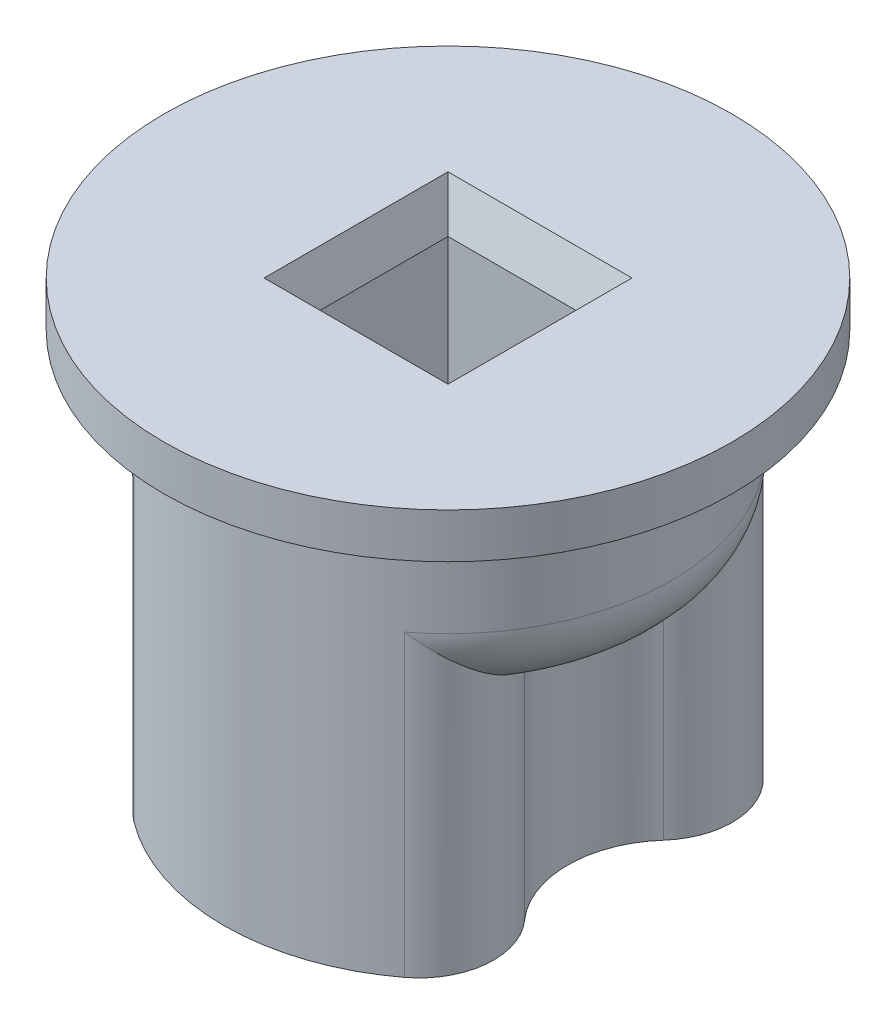
ISO-10303-21;
HEADER;
FILE_DESCRIPTION(('STEP AP214'),'2;1');
FILE_NAME('part.step','',(''),(''),'','','');
FILE_SCHEMA(('AUTOMOTIVE_DESIGN { 1 0 10303 214 1 1 1 1 }'));
ENDSEC;
DATA;
#1=APPLICATION_CONTEXT('core data for automotive mechanical design processes');
#2=APPLICATION_PROTOCOL_DEFINITION('international standard','automotive_design',2000,#1);
#3=PRODUCT_CONTEXT('',#1,'mechanical');
#4=PRODUCT('Part','Part','',(#3));
#5=PRODUCT_RELATED_PRODUCT_CATEGORY('part','',(#4));
#6=PRODUCT_DEFINITION_FORMATION('','',#4);
#7=PRODUCT_DEFINITION_CONTEXT('part definition',#1,'design');
#8=PRODUCT_DEFINITION('design','',#6,#7);
#9=PRODUCT_DEFINITION_SHAPE('','',#8);
#10=(LENGTH_UNIT() NAMED_UNIT(*) SI_UNIT(.MILLI.,.METRE.));
#11=(NAMED_UNIT(*) PLANE_ANGLE_UNIT() SI_UNIT($,.RADIAN.));
#12=(NAMED_UNIT(*) SI_UNIT($,.STERADIAN.) SOLID_ANGLE_UNIT());
#13=UNCERTAINTY_MEASURE_WITH_UNIT(LENGTH_MEASURE(1.E-05),#10,'distance_accuracy_value','');
#14=(GEOMETRIC_REPRESENTATION_CONTEXT(3) GLOBAL_UNCERTAINTY_ASSIGNED_CONTEXT((#13)) GLOBAL_UNIT_ASSIGNED_CONTEXT((#10,
#11,#12)) REPRESENTATION_CONTEXT('',''));
#15=CARTESIAN_POINT('',(0.,0.,0.));
#16=DIRECTION('',(0.,0.,1.));
#17=DIRECTION('',(1.,0.,0.));
#18=AXIS2_PLACEMENT_3D('',#15,#16,#17);
#19=CARTESIAN_POINT('',(0.,80.,0.));
#20=DIRECTION('',(0.,-1.,0.));
#21=DIRECTION('',(0.,0.,-1.));
#22=AXIS2_PLACEMENT_3D('',#19,#20,#21);
#23=CYLINDRICAL_SURFACE('',#22,15.);
#24=DIRECTION('',(0.,-1.,0.));
#25=VECTOR('',#24,1.);
#26=CARTESIAN_POINT('',(9.05,80.,11.9623367282484));
#27=LINE('',#26,#25);
#28=CARTESIAN_POINT('',(9.05,50.,11.9623367282484));
#29=VERTEX_POINT('',#28);
#30=CARTESIAN_POINT('',(9.05,70.,11.9623367282484));
#31=VERTEX_POINT('',#30);
#32=EDGE_CURVE('E238',#29,#31,#27,.F.);
#33=ORIENTED_EDGE('',*,*,#32,.T.);
#34=CARTESIAN_POINT('',(0.,70.,0.));
#35=DIRECTION('',(0.,-1.,0.));
#36=DIRECTION('',(0.,0.,-1.));
#37=AXIS2_PLACEMENT_3D('',#34,#35,#36);
#38=CIRCLE('',#37,15.);
#39=CARTESIAN_POINT('',(9.05,70.,-11.9623367282484));
#40=VERTEX_POINT('',#39);
#41=EDGE_CURVE('E260',#31,#40,#38,.F.);
#42=ORIENTED_EDGE('',*,*,#41,.T.);
#43=DIRECTION('',(0.,-1.,0.));
#44=VECTOR('',#43,1.);
#45=CARTESIAN_POINT('',(9.05,80.,-11.9623367282484));
#46=LINE('',#45,#44);
#47=CARTESIAN_POINT('',(9.05,50.,-11.9623367282484));
#48=VERTEX_POINT('',#47);
#49=EDGE_CURVE('E235',#40,#48,#46,.T.);
#50=ORIENTED_EDGE('',*,*,#49,.T.);
#51=CARTESIAN_POINT('',(0.,50.,0.));
#52=DIRECTION('',(0.,1.,0.));
#53=DIRECTION('',(0.,0.,1.));
#54=AXIS2_PLACEMENT_3D('',#51,#52,#53);
#55=CIRCLE('',#54,15.);
#56=CARTESIAN_POINT('',(-9.05,50.,-11.9623367282484));
#57=VERTEX_POINT('',#56);
#58=EDGE_CURVE('E183',#48,#57,#55,.T.);
#59=ORIENTED_EDGE('',*,*,#58,.T.);
#60=DIRECTION('',(0.,-1.,0.));
#61=VECTOR('',#60,1.);
#62=CARTESIAN_POINT('',(-9.05,80.,-11.9623367282484));
#63=LINE('',#62,#61);
#64=CARTESIAN_POINT('',(-9.05,70.,-11.9623367282484));
#65=VERTEX_POINT('',#64);
#66=EDGE_CURVE('E172',#57,#65,#63,.F.);
#67=ORIENTED_EDGE('',*,*,#66,.T.);
#68=CARTESIAN_POINT('',(0.,70.,0.));
#69=DIRECTION('',(0.,-1.,0.));
#70=DIRECTION('',(0.,0.,-1.));
#71=AXIS2_PLACEMENT_3D('',#68,#69,#70);
#72=CIRCLE('',#71,15.);
#73=CARTESIAN_POINT('',(-9.05,70.,11.9623367282484));
#74=VERTEX_POINT('',#73);
#75=EDGE_CURVE('E257',#65,#74,#72,.F.);
#76=ORIENTED_EDGE('',*,*,#75,.T.);
#77=DIRECTION('',(0.,-1.,0.));
#78=VECTOR('',#77,1.);
#79=CARTESIAN_POINT('',(-9.05,80.,11.9623367282484));
#80=LINE('',#79,#78);
#81=CARTESIAN_POINT('',(-9.05,50.,11.9623367282484));
#82=VERTEX_POINT('',#81);
#83=EDGE_CURVE('E232',#74,#82,#80,.T.);
#84=ORIENTED_EDGE('',*,*,#83,.T.);
#85=EDGE_CURVE('E223',#82,#29,#55,.T.);
#86=ORIENTED_EDGE('',*,*,#85,.T.);
#87=EDGE_LOOP('',(#33,#42,#50,#59,#67,#76,#84,#86));
#88=FACE_BOUND('',#87,.T.);
#89=CARTESIAN_POINT('',(0.,77.,0.));
#90=DIRECTION('',(0.,1.,0.));
#91=DIRECTION('',(0.,0.,1.));
#92=AXIS2_PLACEMENT_3D('',#89,#90,#91);
#93=CIRCLE('',#92,15.);
#94=CARTESIAN_POINT('',(0.,77.,15.));
#95=VERTEX_POINT('',#94);
#96=EDGE_CURVE('E197',#95,#95,#93,.T.);
#97=ORIENTED_EDGE('',*,*,#96,.F.);
#98=EDGE_LOOP('',(#97));
#99=FACE_BOUND('',#98,.T.);
#100=ADVANCED_FACE('F42',(#88,#99),#23,.T.);
#101=CARTESIAN_POINT('',(0.,80.,0.));
#102=DIRECTION('',(0.,1.,0.));
#103=DIRECTION('',(0.,0.,1.));
#104=AXIS2_PLACEMENT_3D('',#101,#102,#103);
#105=PLANE('',#104);
#106=DIRECTION('',(1.,0.,0.));
#107=VECTOR('',#106,1.);
#108=CARTESIAN_POINT('',(0.,80.,-6.14999999999999));
#109=LINE('',#108,#107);
#110=CARTESIAN_POINT('',(-6.14999999999999,80.,-6.14999999999999));
#111=VERTEX_POINT('',#110);
#112=CARTESIAN_POINT('',(6.15,80.,-6.14999999999999));
#113=VERTEX_POINT('',#112);
#114=EDGE_CURVE('E206',#111,#113,#109,.T.);
#115=ORIENTED_EDGE('',*,*,#114,.T.);
#116=DIRECTION('',(0.,0.,1.));
#117=VECTOR('',#116,1.);
#118=CARTESIAN_POINT('',(6.15,80.,0.));
#119=LINE('',#118,#117);
#120=CARTESIAN_POINT('',(6.15,80.,6.15));
#121=VERTEX_POINT('',#120);
#122=EDGE_CURVE('E212',#113,#121,#119,.T.);
#123=ORIENTED_EDGE('',*,*,#122,.T.);
#124=DIRECTION('',(-1.,0.,0.));
#125=VECTOR('',#124,1.);
#126=CARTESIAN_POINT('',(0.,80.,6.15));
#127=LINE('',#126,#125);
#128=CARTESIAN_POINT('',(-6.14999999999999,80.,6.15));
#129=VERTEX_POINT('',#128);
#130=EDGE_CURVE('E210',#121,#129,#127,.T.);
#131=ORIENTED_EDGE('',*,*,#130,.T.);
#132=DIRECTION('',(0.,0.,-1.));
#133=VECTOR('',#132,1.);
#134=CARTESIAN_POINT('',(-6.14999999999999,80.,0.));
#135=LINE('',#134,#133);
#136=EDGE_CURVE('E208',#129,#111,#135,.T.);
#137=ORIENTED_EDGE('',*,*,#136,.T.);
#138=EDGE_LOOP('',(#115,#123,#131,#137));
#139=FACE_BOUND('',#138,.T.);
#140=CARTESIAN_POINT('',(0.,80.,0.));
#141=DIRECTION('',(0.,1.,0.));
#142=DIRECTION('',(0.,0.,1.));
#143=AXIS2_PLACEMENT_3D('',#140,#141,#142);
#144=CIRCLE('',#143,19.);
#145=CARTESIAN_POINT('',(0.,80.,19.));
#146=VERTEX_POINT('',#145);
#147=EDGE_CURVE('E194',#146,#146,#144,.T.);
#148=ORIENTED_EDGE('',*,*,#147,.T.);
#149=EDGE_LOOP('',(#148));
#150=FACE_BOUND('',#149,.T.);
#151=ADVANCED_FACE('F360',(#139,#150),#105,.T.);
#152=CARTESIAN_POINT('',(-5.15,80.,5.15));
#153=DIRECTION('',(1.,0.,0.));
#154=DIRECTION('',(0.,0.,-1.));
#155=AXIS2_PLACEMENT_3D('',#152,#153,#154);
#156=PLANE('',#155);
#157=DIRECTION('',(0.,0.,1.));
#158=VECTOR('',#157,1.);
#159=CARTESIAN_POINT('',(-5.15,50.,5.15));
#160=LINE('',#159,#158);
#161=CARTESIAN_POINT('',(-5.15,50.,-5.15));
#162=VERTEX_POINT('',#161);
#163=CARTESIAN_POINT('',(-5.15,50.,5.15));
#164=VERTEX_POINT('',#163);
#165=EDGE_CURVE('E164',#162,#164,#160,.T.);
#166=ORIENTED_EDGE('',*,*,#165,.F.);
#167=DIRECTION('',(0.,-1.,0.));
#168=VECTOR('',#167,1.);
#169=CARTESIAN_POINT('',(-5.15,80.,-5.15));
#170=LINE('',#169,#168);
#171=CARTESIAN_POINT('',(-5.15,77.2525225805454,-5.15));
#172=VERTEX_POINT('',#171);
#173=EDGE_CURVE('E179',#172,#162,#170,.T.);
#174=ORIENTED_EDGE('',*,*,#173,.F.);
#175=DIRECTION('',(0.,0.,1.));
#176=VECTOR('',#175,1.);
#177=CARTESIAN_POINT('',(-5.15,77.2525225805454,5.15));
#178=LINE('',#177,#176);
#179=CARTESIAN_POINT('',(-5.15,77.2525225805454,5.15));
#180=VERTEX_POINT('',#179);
#181=EDGE_CURVE('E217',#172,#180,#178,.T.);
#182=ORIENTED_EDGE('',*,*,#181,.T.);
#183=DIRECTION('',(0.,-1.,0.));
#184=VECTOR('',#183,1.);
#185=CARTESIAN_POINT('',(-5.15,80.,5.15));
#186=LINE('',#185,#184);
#187=EDGE_CURVE('E182',#180,#164,#186,.T.);
#188=ORIENTED_EDGE('',*,*,#187,.T.);
#189=EDGE_LOOP('',(#166,#174,#182,#188));
#190=FACE_BOUND('',#189,.T.);
#191=ADVANCED_FACE('F178',(#190),#156,.T.);
#192=CARTESIAN_POINT('',(5.15,80.,5.15));
#193=DIRECTION('',(0.,0.,-1.));
#194=DIRECTION('',(-1.,0.,0.));
#195=AXIS2_PLACEMENT_3D('',#192,#193,#194);
#196=PLANE('',#195);
#197=DIRECTION('',(1.,0.,0.));
#198=VECTOR('',#197,1.);
#199=CARTESIAN_POINT('',(5.15,50.,5.15));
#200=LINE('',#199,#198);
#201=CARTESIAN_POINT('',(5.15,50.,5.15));
#202=VERTEX_POINT('',#201);
#203=EDGE_CURVE('E184',#164,#202,#200,.T.);
#204=ORIENTED_EDGE('',*,*,#203,.F.);
#205=ORIENTED_EDGE('',*,*,#187,.F.);
#206=DIRECTION('',(1.,0.,0.));
#207=VECTOR('',#206,1.);
#208=CARTESIAN_POINT('',(5.15,77.2525225805454,5.15));
#209=LINE('',#208,#207);
#210=CARTESIAN_POINT('',(5.15,77.2525225805454,5.15));
#211=VERTEX_POINT('',#210);
#212=EDGE_CURVE('E215',#180,#211,#209,.T.);
#213=ORIENTED_EDGE('',*,*,#212,.T.);
#214=DIRECTION('',(0.,-1.,0.));
#215=VECTOR('',#214,1.);
#216=CARTESIAN_POINT('',(5.15,80.,5.15));
#217=LINE('',#216,#215);
#218=EDGE_CURVE('E191',#211,#202,#217,.T.);
#219=ORIENTED_EDGE('',*,*,#218,.T.);
#220=EDGE_LOOP('',(#204,#205,#213,#219));
#221=FACE_BOUND('',#220,.T.);
#222=ADVANCED_FACE('F353',(#221),#196,.T.);
#223=CARTESIAN_POINT('',(5.15,80.,5.15));
#224=DIRECTION('',(-1.,0.,0.));
#225=DIRECTION('',(0.,0.,1.));
#226=AXIS2_PLACEMENT_3D('',#223,#224,#225);
#227=PLANE('',#226);
#228=DIRECTION('',(0.,0.,-1.));
#229=VECTOR('',#228,1.);
#230=CARTESIAN_POINT('',(5.15,50.,5.15));
#231=LINE('',#230,#229);
#232=CARTESIAN_POINT('',(5.15,50.,-5.15));
#233=VERTEX_POINT('',#232);
#234=EDGE_CURVE('E167',#202,#233,#231,.T.);
#235=ORIENTED_EDGE('',*,*,#234,.F.);
#236=ORIENTED_EDGE('',*,*,#218,.F.);
#237=DIRECTION('',(0.,0.,-1.));
#238=VECTOR('',#237,1.);
#239=CARTESIAN_POINT('',(5.15,77.2525225805454,5.15));
#240=LINE('',#239,#238);
#241=CARTESIAN_POINT('',(5.15,77.2525225805454,-5.15));
#242=VERTEX_POINT('',#241);
#243=EDGE_CURVE('E203',#211,#242,#240,.T.);
#244=ORIENTED_EDGE('',*,*,#243,.T.);
#245=DIRECTION('',(0.,-1.,0.));
#246=VECTOR('',#245,1.);
#247=CARTESIAN_POINT('',(5.15,80.,-5.15));
#248=LINE('',#247,#246);
#249=EDGE_CURVE('E188',#242,#233,#248,.T.);
#250=ORIENTED_EDGE('',*,*,#249,.T.);
#251=EDGE_LOOP('',(#235,#236,#244,#250));
#252=FACE_BOUND('',#251,.T.);
#253=ADVANCED_FACE('F350',(#252),#227,.T.);
#254=CARTESIAN_POINT('',(5.15,80.,-5.15));
#255=DIRECTION('',(0.,0.,1.));
#256=DIRECTION('',(1.,0.,0.));
#257=AXIS2_PLACEMENT_3D('',#254,#255,#256);
#258=PLANE('',#257);
#259=DIRECTION('',(-1.,0.,0.));
#260=VECTOR('',#259,1.);
#261=CARTESIAN_POINT('',(5.15,50.,-5.15));
#262=LINE('',#261,#260);
#263=EDGE_CURVE('E160',#233,#162,#262,.T.);
#264=ORIENTED_EDGE('',*,*,#263,.F.);
#265=ORIENTED_EDGE('',*,*,#249,.F.);
#266=DIRECTION('',(-1.,0.,0.));
#267=VECTOR('',#266,1.);
#268=CARTESIAN_POINT('',(5.15,77.2525225805454,-5.15));
#269=LINE('',#268,#267);
#270=EDGE_CURVE('E173',#242,#172,#269,.T.);
#271=ORIENTED_EDGE('',*,*,#270,.T.);
#272=ORIENTED_EDGE('',*,*,#173,.T.);
#273=EDGE_LOOP('',(#264,#265,#271,#272));
#274=FACE_BOUND('',#273,.T.);
#275=ADVANCED_FACE('F186',(#274),#258,.T.);
#276=CARTESIAN_POINT('',(0.,77.,0.));
#277=DIRECTION('',(0.,1.,0.));
#278=DIRECTION('',(0.,0.,1.));
#279=AXIS2_PLACEMENT_3D('',#276,#277,#278);
#280=PLANE('',#279);
#281=CARTESIAN_POINT('',(0.,77.,0.));
#282=DIRECTION('',(0.,1.,0.));
#283=DIRECTION('',(0.,0.,1.));
#284=AXIS2_PLACEMENT_3D('',#281,#282,#283);
#285=CIRCLE('',#284,19.);
#286=CARTESIAN_POINT('',(0.,77.,19.));
#287=VERTEX_POINT('',#286);
#288=EDGE_CURVE('E189',#287,#287,#285,.T.);
#289=ORIENTED_EDGE('',*,*,#288,.F.);
#290=EDGE_LOOP('',(#289));
#291=FACE_BOUND('',#290,.T.);
#292=ORIENTED_EDGE('',*,*,#96,.T.);
#293=EDGE_LOOP('',(#292));
#294=FACE_BOUND('',#293,.T.);
#295=ADVANCED_FACE('F339',(#291,#294),#280,.F.);
#296=CARTESIAN_POINT('',(0.,77.,0.));
#297=DIRECTION('',(0.,1.,0.));
#298=DIRECTION('',(0.,0.,1.));
#299=AXIS2_PLACEMENT_3D('',#296,#297,#298);
#300=CYLINDRICAL_SURFACE('',#299,19.);
#301=ORIENTED_EDGE('',*,*,#288,.T.);
#302=EDGE_LOOP('',(#301));
#303=FACE_BOUND('',#302,.T.);
#304=ORIENTED_EDGE('',*,*,#147,.F.);
#305=EDGE_LOOP('',(#304));
#306=FACE_BOUND('',#305,.T.);
#307=ADVANCED_FACE('F342',(#303,#306),#300,.T.);
#308=CARTESIAN_POINT('',(-5.15,77.2525225805454,5.15));
#309=DIRECTION('',(-0.939692620785909,-0.342020143325667,0.));
#310=DIRECTION('',(0.,0.,1.));
#311=AXIS2_PLACEMENT_3D('',#308,#309,#310);
#312=PLANE('',#311);
#313=DIRECTION('',(0.323615577118183,-0.889126490715989,0.323615577118183));
#314=VECTOR('',#313,1.);
#315=CARTESIAN_POINT('',(-4.07131146993859,74.2888502015769,-4.07131146993859));
#316=LINE('',#315,#314);
#317=EDGE_CURVE('E225',#111,#172,#316,.T.);
#318=ORIENTED_EDGE('',*,*,#317,.F.);
#319=ORIENTED_EDGE('',*,*,#136,.F.);
#320=DIRECTION('',(0.323615577118183,-0.889126490715989,-0.323615577118183));
#321=VECTOR('',#320,1.);
#322=CARTESIAN_POINT('',(-4.07131146993859,74.2888502015769,4.07131146993859));
#323=LINE('',#322,#321);
#324=EDGE_CURVE('E228',#180,#129,#323,.F.);
#325=ORIENTED_EDGE('',*,*,#324,.F.);
#326=ORIENTED_EDGE('',*,*,#181,.F.);
#327=EDGE_LOOP('',(#318,#319,#325,#326));
#328=FACE_BOUND('',#327,.T.);
#329=ADVANCED_FACE('F346',(#328),#312,.F.);
#330=CARTESIAN_POINT('',(5.15,77.2525225805454,5.15));
#331=DIRECTION('',(0.,-0.342020143325667,0.939692620785909));
#332=DIRECTION('',(1.,0.,0.));
#333=AXIS2_PLACEMENT_3D('',#330,#331,#332);
#334=PLANE('',#333);
#335=ORIENTED_EDGE('',*,*,#324,.T.);
#336=ORIENTED_EDGE('',*,*,#130,.F.);
#337=DIRECTION('',(-0.323615577118183,-0.889126490715989,-0.323615577118183));
#338=VECTOR('',#337,1.);
#339=CARTESIAN_POINT('',(5.15,77.2525225805454,5.15));
#340=LINE('',#339,#338);
#341=EDGE_CURVE('E222',#211,#121,#340,.F.);
#342=ORIENTED_EDGE('',*,*,#341,.F.);
#343=ORIENTED_EDGE('',*,*,#212,.F.);
#344=EDGE_LOOP('',(#335,#336,#342,#343));
#345=FACE_BOUND('',#344,.T.);
#346=ADVANCED_FACE('F373',(#345),#334,.F.);
#347=CARTESIAN_POINT('',(5.15,77.2525225805454,-5.15));
#348=DIRECTION('',(0.,-0.342020143325667,-0.939692620785909));
#349=DIRECTION('',(-1.,0.,0.));
#350=AXIS2_PLACEMENT_3D('',#347,#348,#349);
#351=PLANE('',#350);
#352=ORIENTED_EDGE('',*,*,#317,.T.);
#353=ORIENTED_EDGE('',*,*,#270,.F.);
#354=DIRECTION('',(0.323615577118183,0.889126490715989,-0.323615577118183));
#355=VECTOR('',#354,1.);
#356=CARTESIAN_POINT('',(4.07131146993859,74.2888502015769,-4.07131146993859));
#357=LINE('',#356,#355);
#358=EDGE_CURVE('E220',#113,#242,#357,.F.);
#359=ORIENTED_EDGE('',*,*,#358,.F.);
#360=ORIENTED_EDGE('',*,*,#114,.F.);
#361=EDGE_LOOP('',(#352,#353,#359,#360));
#362=FACE_BOUND('',#361,.T.);
#363=ADVANCED_FACE('F369',(#362),#351,.F.);
#364=CARTESIAN_POINT('',(5.15,77.2525225805454,5.15));
#365=DIRECTION('',(0.939692620785909,-0.342020143325667,0.));
#366=DIRECTION('',(0.,0.,-1.));
#367=AXIS2_PLACEMENT_3D('',#364,#365,#366);
#368=PLANE('',#367);
#369=ORIENTED_EDGE('',*,*,#341,.T.);
#370=ORIENTED_EDGE('',*,*,#122,.F.);
#371=ORIENTED_EDGE('',*,*,#358,.T.);
#372=ORIENTED_EDGE('',*,*,#243,.F.);
#373=EDGE_LOOP('',(#369,#370,#371,#372));
#374=FACE_BOUND('',#373,.T.);
#375=ADVANCED_FACE('F338',(#374),#368,.F.);
#376=CARTESIAN_POINT('',(0.,50.,0.));
#377=DIRECTION('',(0.,1.,0.));
#378=DIRECTION('',(0.,0.,1.));
#379=AXIS2_PLACEMENT_3D('',#376,#377,#378);
#380=PLANE('',#379);
#381=ORIENTED_EDGE('',*,*,#165,.T.);
#382=ORIENTED_EDGE('',*,*,#203,.T.);
#383=ORIENTED_EDGE('',*,*,#234,.T.);
#384=ORIENTED_EDGE('',*,*,#263,.T.);
#385=EDGE_LOOP('',(#381,#382,#383,#384));
#386=FACE_BOUND('',#385,.T.);
#387=CARTESIAN_POINT('',(15.,50.,0.));
#388=DIRECTION('',(0.,-1.,0.));
#389=DIRECTION('',(0.,0.,-1.));
#390=AXIS2_PLACEMENT_3D('',#387,#388,#389);
#391=CIRCLE('',#390,7.);
#392=CARTESIAN_POINT('',(9.76944444444444,50.,4.65201983876326));
#393=VERTEX_POINT('',#392);
#394=CARTESIAN_POINT('',(9.76944444444444,50.,-4.65201983876326));
#395=VERTEX_POINT('',#394);
#396=EDGE_CURVE('E429',#393,#395,#391,.T.);
#397=ORIENTED_EDGE('',*,*,#396,.F.);
#398=CARTESIAN_POINT('',(6.03333333333333,50.,7.97489115216558));
#399=DIRECTION('',(0.,1.,0.));
#400=DIRECTION('',(0.,0.,1.));
#401=AXIS2_PLACEMENT_3D('',#398,#399,#400);
#402=CIRCLE('',#401,5.);
#403=EDGE_CURVE('E250',#393,#29,#402,.F.);
#404=ORIENTED_EDGE('',*,*,#403,.T.);
#405=ORIENTED_EDGE('',*,*,#85,.F.);
#406=CARTESIAN_POINT('',(-6.03333333333333,50.,7.97489115216558));
#407=DIRECTION('',(0.,1.,0.));
#408=DIRECTION('',(0.,0.,1.));
#409=AXIS2_PLACEMENT_3D('',#406,#407,#408);
#410=CIRCLE('',#409,5.);
#411=CARTESIAN_POINT('',(-9.76944444444444,50.,4.65201983876326));
#412=VERTEX_POINT('',#411);
#413=EDGE_CURVE('E246',#82,#412,#410,.F.);
#414=ORIENTED_EDGE('',*,*,#413,.T.);
#415=CARTESIAN_POINT('',(-15.,50.,0.));
#416=DIRECTION('',(0.,-1.,0.));
#417=DIRECTION('',(0.,0.,-1.));
#418=AXIS2_PLACEMENT_3D('',#415,#416,#417);
#419=CIRCLE('',#418,7.);
#420=CARTESIAN_POINT('',(-9.76944444444444,50.,-4.65201983876326));
#421=VERTEX_POINT('',#420);
#422=EDGE_CURVE('E397',#421,#412,#419,.T.);
#423=ORIENTED_EDGE('',*,*,#422,.F.);
#424=CARTESIAN_POINT('',(-6.03333333333333,50.,-7.97489115216558));
#425=DIRECTION('',(0.,1.,0.));
#426=DIRECTION('',(0.,0.,1.));
#427=AXIS2_PLACEMENT_3D('',#424,#425,#426);
#428=CIRCLE('',#427,5.);
#429=EDGE_CURVE('E244',#421,#57,#428,.F.);
#430=ORIENTED_EDGE('',*,*,#429,.T.);
#431=ORIENTED_EDGE('',*,*,#58,.F.);
#432=CARTESIAN_POINT('',(6.03333333333333,50.,-7.97489115216558));
#433=DIRECTION('',(0.,1.,0.));
#434=DIRECTION('',(0.,0.,1.));
#435=AXIS2_PLACEMENT_3D('',#432,#433,#434);
#436=CIRCLE('',#435,5.);
#437=EDGE_CURVE('E248',#48,#395,#436,.F.);
#438=ORIENTED_EDGE('',*,*,#437,.T.);
#439=EDGE_LOOP('',(#397,#404,#405,#414,#423,#430,#431,#438));
#440=FACE_BOUND('',#439,.T.);
#441=ADVANCED_FACE('F162',(#386,#440),#380,.F.);
#442=CARTESIAN_POINT('',(-15.,65.,0.));
#443=DIRECTION('',(0.,-1.,0.));
#444=DIRECTION('',(0.,0.,-1.));
#445=AXIS2_PLACEMENT_3D('',#442,#443,#444);
#446=PLANE('',#445);
#447=CARTESIAN_POINT('',(-15.,65.,0.));
#448=DIRECTION('',(0.,-1.,0.));
#449=DIRECTION('',(0.,0.,-1.));
#450=AXIS2_PLACEMENT_3D('',#447,#448,#449);
#451=CIRCLE('',#450,7.);
#452=CARTESIAN_POINT('',(-9.2,65.,-3.91918358845308));
#453=VERTEX_POINT('',#452);
#454=CARTESIAN_POINT('',(-9.2,65.,3.91918358845308));
#455=VERTEX_POINT('',#454);
#456=EDGE_CURVE('E393',#453,#455,#451,.T.);
#457=ORIENTED_EDGE('',*,*,#456,.T.);
#458=CARTESIAN_POINT('',(0.,65.,0.));
#459=DIRECTION('',(0.,-1.,0.));
#460=DIRECTION('',(0.,0.,-1.));
#461=AXIS2_PLACEMENT_3D('',#458,#459,#460);
#462=CIRCLE('',#461,10.);
#463=EDGE_CURVE('E263',#455,#453,#462,.T.);
#464=ORIENTED_EDGE('',*,*,#463,.T.);
#465=EDGE_LOOP('',(#457,#464));
#466=FACE_BOUND('',#465,.T.);
#467=ADVANCED_FACE('F334',(#466),#446,.T.);
#468=CARTESIAN_POINT('',(-15.,65.,0.));
#469=DIRECTION('',(0.,-1.,0.));
#470=DIRECTION('',(0.,0.,-1.));
#471=AXIS2_PLACEMENT_3D('',#468,#469,#470);
#472=CYLINDRICAL_SURFACE('',#471,7.);
#473=ORIENTED_EDGE('',*,*,#422,.T.);
#474=DIRECTION('',(0.,-1.,0.));
#475=VECTOR('',#474,1.);
#476=CARTESIAN_POINT('',(-9.76944444444444,65.,4.65201983876326));
#477=LINE('',#476,#475);
#478=CARTESIAN_POINT('',(-9.76944444444444,65.0677823268778,4.65201983876326));
#479=VERTEX_POINT('',#478);
#480=EDGE_CURVE('E61',#412,#479,#477,.F.);
#481=ORIENTED_EDGE('',*,*,#480,.T.);
#482=CARTESIAN_POINT('',(-9.76944444444444,65.0677823268778,4.65201983876326));
#483=CARTESIAN_POINT('',(-9.71834630001908,65.0559942106238,4.5945725117439));
#484=CARTESIAN_POINT('',(-9.66803707422808,65.0458488058953,4.53609527400073));
#485=CARTESIAN_POINT('',(-9.56928900683864,65.0287088103162,4.4173873011762));
#486=CARTESIAN_POINT('',(-9.5208457373191,65.0217062785506,4.35716139943442));
#487=CARTESIAN_POINT('',(-9.42586416625592,65.0106595141724,4.23497326222592));
#488=CARTESIAN_POINT('',(-9.3793257283246,65.006615069407,4.17301115161038));
#489=CARTESIAN_POINT('',(-9.2881605240945,65.0012797530098,4.04733751794638));
#490=CARTESIAN_POINT('',(-9.24353893009761,64.9999959227342,3.98362194019172));
#491=CARTESIAN_POINT('',(-9.2,65.,3.91918358845309));
#492=B_SPLINE_CURVE_WITH_KNOTS('',3,(#482,#483,#484,#485,#486,#487,#488,#489,#490,#491),
.UNSPECIFIED.,.F.,.F.,(4,2,2,2,4),(0.,0.23331127890085,0.466029698599745,0.698731426195379,
0.932025993420359),.UNSPECIFIED.);
#493=EDGE_CURVE('E13',#479,#455,#492,.T.);
#494=ORIENTED_EDGE('',*,*,#493,.T.);
#495=ORIENTED_EDGE('',*,*,#456,.F.);
#496=CARTESIAN_POINT('',(-9.2,65.,-3.91918358845308));
#497=CARTESIAN_POINT('',(-9.24353893009761,64.9999959227342,-3.98362194019172));
#498=CARTESIAN_POINT('',(-9.2881605240945,65.0012797530098,-4.04733751794638));
#499=CARTESIAN_POINT('',(-9.3793257283246,65.006615069407,-4.17301115161038));
#500=CARTESIAN_POINT('',(-9.42586416625592,65.0106595141724,-4.23497326222592));
#501=CARTESIAN_POINT('',(-9.5208457373191,65.0217062785506,-4.35716139943442));
#502=CARTESIAN_POINT('',(-9.56928900683864,65.0287088103162,-4.4173873011762));
#503=CARTESIAN_POINT('',(-9.66803707422808,65.0458488058953,-4.53609527400073));
#504=CARTESIAN_POINT('',(-9.71834630001908,65.0559942106238,-4.5945725117439));
#505=CARTESIAN_POINT('',(-9.76944444444444,65.0677823268778,-4.65201983876325));
#506=B_SPLINE_CURVE_WITH_KNOTS('',3,(#496,#497,#498,#499,#500,#501,#502,#503,#504,#505),
.UNSPECIFIED.,.F.,.F.,(4,2,2,2,4),(0.,0.233294567224982,0.465996294820616,0.698714714519511,
0.93202599342036),.UNSPECIFIED.);
#507=CARTESIAN_POINT('',(-9.76944444444444,65.0677823268778,-4.65201983876326));
#508=VERTEX_POINT('',#507);
#509=EDGE_CURVE('E325',#453,#508,#506,.T.);
#510=ORIENTED_EDGE('',*,*,#509,.T.);
#511=DIRECTION('',(0.,-1.,0.));
#512=VECTOR('',#511,1.);
#513=CARTESIAN_POINT('',(-9.76944444444444,65.,-4.65201983876326));
#514=LINE('',#513,#512);
#515=EDGE_CURVE('E69',#508,#421,#514,.T.);
#516=ORIENTED_EDGE('',*,*,#515,.T.);
#517=EDGE_LOOP('',(#473,#481,#494,#495,#510,#516));
#518=FACE_BOUND('',#517,.T.);
#519=ADVANCED_FACE('F329',(#518),#472,.F.);
#520=CARTESIAN_POINT('',(15.,65.,0.));
#521=DIRECTION('',(0.,-1.,0.));
#522=DIRECTION('',(0.,0.,-1.));
#523=AXIS2_PLACEMENT_3D('',#520,#521,#522);
#524=PLANE('',#523);
#525=CARTESIAN_POINT('',(15.,65.,0.));
#526=DIRECTION('',(0.,-1.,0.));
#527=DIRECTION('',(0.,0.,-1.));
#528=AXIS2_PLACEMENT_3D('',#525,#526,#527);
#529=CIRCLE('',#528,7.);
#530=CARTESIAN_POINT('',(9.2,65.,3.91918358845308));
#531=VERTEX_POINT('',#530);
#532=CARTESIAN_POINT('',(9.2,65.,-3.91918358845308));
#533=VERTEX_POINT('',#532);
#534=EDGE_CURVE('E427',#531,#533,#529,.T.);
#535=ORIENTED_EDGE('',*,*,#534,.T.);
#536=CARTESIAN_POINT('',(0.,65.,0.));
#537=DIRECTION('',(0.,-1.,0.));
#538=DIRECTION('',(0.,0.,-1.));
#539=AXIS2_PLACEMENT_3D('',#536,#537,#538);
#540=CIRCLE('',#539,10.);
#541=EDGE_CURVE('E254',#533,#531,#540,.T.);
#542=ORIENTED_EDGE('',*,*,#541,.T.);
#543=EDGE_LOOP('',(#535,#542));
#544=FACE_BOUND('',#543,.T.);
#545=ADVANCED_FACE('F333',(#544),#524,.T.);
#546=CARTESIAN_POINT('',(15.,65.,0.));
#547=DIRECTION('',(0.,-1.,0.));
#548=DIRECTION('',(0.,0.,-1.));
#549=AXIS2_PLACEMENT_3D('',#546,#547,#548);
#550=CYLINDRICAL_SURFACE('',#549,7.);
#551=ORIENTED_EDGE('',*,*,#534,.F.);
#552=CARTESIAN_POINT('',(9.2,65.,3.91918358845308));
#553=CARTESIAN_POINT('',(9.24353893009761,64.9999959227342,3.98362194019172));
#554=CARTESIAN_POINT('',(9.2881605240945,65.0012797530098,4.04733751794638));
#555=CARTESIAN_POINT('',(9.3793257283246,65.006615069407,4.17301115161038));
#556=CARTESIAN_POINT('',(9.42586416625592,65.0106595141724,4.23497326222592));
#557=CARTESIAN_POINT('',(9.5208457373191,65.0217062785506,4.35716139943442));
#558=CARTESIAN_POINT('',(9.56928900683864,65.0287088103162,4.4173873011762));
#559=CARTESIAN_POINT('',(9.66803707422808,65.0458488058953,4.53609527400073));
#560=CARTESIAN_POINT('',(9.71834630001908,65.0559942106238,4.5945725117439));
#561=CARTESIAN_POINT('',(9.76944444444444,65.0677823268778,4.65201983876325));
#562=B_SPLINE_CURVE_WITH_KNOTS('',3,(#552,#553,#554,#555,#556,#557,#558,#559,#560,#561),
.UNSPECIFIED.,.F.,.F.,(4,2,2,2,4),(0.,0.233294567224982,0.465996294820616,0.698714714519511,
0.93202599342036),.UNSPECIFIED.);
#563=CARTESIAN_POINT('',(9.76944444444444,65.0677823268778,4.65201983876326));
#564=VERTEX_POINT('',#563);
#565=EDGE_CURVE('E266',#531,#564,#562,.T.);
#566=ORIENTED_EDGE('',*,*,#565,.T.);
#567=DIRECTION('',(0.,-1.,0.));
#568=VECTOR('',#567,1.);
#569=CARTESIAN_POINT('',(9.76944444444444,65.,4.65201983876326));
#570=LINE('',#569,#568);
#571=EDGE_CURVE('E242',#564,#393,#570,.T.);
#572=ORIENTED_EDGE('',*,*,#571,.T.);
#573=ORIENTED_EDGE('',*,*,#396,.T.);
#574=DIRECTION('',(0.,-1.,0.));
#575=VECTOR('',#574,1.);
#576=CARTESIAN_POINT('',(9.76944444444444,65.,-4.65201983876326));
#577=LINE('',#576,#575);
#578=CARTESIAN_POINT('',(9.76944444444444,65.0677823268778,-4.65201983876326));
#579=VERTEX_POINT('',#578);
#580=EDGE_CURVE('E240',#395,#579,#577,.F.);
#581=ORIENTED_EDGE('',*,*,#580,.T.);
#582=CARTESIAN_POINT('',(9.76944444444444,65.0677823268778,-4.65201983876326));
#583=CARTESIAN_POINT('',(9.71834630001908,65.0559942106238,-4.5945725117439));
#584=CARTESIAN_POINT('',(9.66803707422808,65.0458488058953,-4.53609527400073));
#585=CARTESIAN_POINT('',(9.56928900683864,65.0287088103162,-4.4173873011762));
#586=CARTESIAN_POINT('',(9.5208457373191,65.0217062785506,-4.35716139943442));
#587=CARTESIAN_POINT('',(9.42586416625592,65.0106595141724,-4.23497326222592));
#588=CARTESIAN_POINT('',(9.3793257283246,65.006615069407,-4.17301115161038));
#589=CARTESIAN_POINT('',(9.2881605240945,65.0012797530098,-4.04733751794638));
#590=CARTESIAN_POINT('',(9.24353893009761,64.9999959227342,-3.98362194019172));
#591=CARTESIAN_POINT('',(9.2,65.,-3.91918358845309));
#592=B_SPLINE_CURVE_WITH_KNOTS('',3,(#582,#583,#584,#585,#586,#587,#588,#589,#590,#591),
.UNSPECIFIED.,.F.,.F.,(4,2,2,2,4),(0.,0.23331127890085,0.466029698599745,0.698731426195379,
0.932025993420359),.UNSPECIFIED.);
#593=EDGE_CURVE('E301',#579,#533,#592,.T.);
#594=ORIENTED_EDGE('',*,*,#593,.T.);
#595=EDGE_LOOP('',(#551,#566,#572,#573,#581,#594));
#596=FACE_BOUND('',#595,.T.);
#597=ADVANCED_FACE('F279',(#596),#550,.F.);
#598=CARTESIAN_POINT('',(6.03333333333333,65.,7.97489115216558));
#599=DIRECTION('',(0.,-1.,0.));
#600=DIRECTION('',(0.,0.,-1.));
#601=AXIS2_PLACEMENT_3D('',#598,#599,#600);
#602=CYLINDRICAL_SURFACE('',#601,5.);
#603=ORIENTED_EDGE('',*,*,#403,.F.);
#604=ORIENTED_EDGE('',*,*,#571,.F.);
#605=CARTESIAN_POINT('',(9.76944444444444,65.0677823268778,4.65201983876325));
#606=CARTESIAN_POINT('',(9.85619301650379,65.0877801079232,4.74952291306321));
#607=CARTESIAN_POINT('',(9.93861953690426,65.1119224723676,4.84992046695215));
#608=CARTESIAN_POINT('',(10.0944567147328,65.167668077354,5.05533385722764));
#609=CARTESIAN_POINT('',(10.1678784381498,65.1992620181428,5.16034380535936));
#610=CARTESIAN_POINT('',(10.3050287945984,65.2688710457006,5.37324793567645));
#611=CARTESIAN_POINT('',(10.3688267366421,65.3068356015305,5.48111419373058));
#612=CARTESIAN_POINT('',(10.4873628241877,65.3886188966382,5.69957099459474));
#613=CARTESIAN_POINT('',(10.5420982026951,65.4324394165143,5.81016235764087));
#614=CARTESIAN_POINT('',(10.6922444083823,65.5711830880647,6.14358823410201));
#615=CARTESIAN_POINT('',(10.7743899472721,65.6738083949422,6.36932962424244));
#616=CARTESIAN_POINT('',(10.904588062185,65.8951292052323,6.82301338384579));
#617=CARTESIAN_POINT('',(10.9525659484996,66.0138592433732,7.05095947780585));
#618=CARTESIAN_POINT('',(11.0212349689202,66.2826084218297,7.53872402337986));
#619=CARTESIAN_POINT('',(11.0367163505132,66.4346455426467,7.79816177389537));
#620=CARTESIAN_POINT('',(11.0287184488167,66.7508945330679,8.30857856585515));
#621=CARTESIAN_POINT('',(11.0052403342383,66.9151060373223,8.55955786080664));
#622=CARTESIAN_POINT('',(10.9144825225355,67.2869699759844,9.09896850664463));
#623=CARTESIAN_POINT('',(10.8392783329954,67.4966737369989,9.38465949107422));
#624=CARTESIAN_POINT('',(10.6432544906559,67.9253495450851,9.93283195314439));
#625=CARTESIAN_POINT('',(10.522370106133,68.1443343511745,10.1952798393317));
#626=CARTESIAN_POINT('',(10.2128056357538,68.6315287370538,10.7404884389436));
#627=CARTESIAN_POINT('',(10.0155002974825,68.9010072352009,11.0172237368824));
#628=CARTESIAN_POINT('',(9.57222614174521,69.4434878707152,11.5229804804211));
#629=CARTESIAN_POINT('',(9.32636686626505,69.7164808063431,11.7521069904312));
#630=CARTESIAN_POINT('',(9.05712927139766,69.9926971091211,11.9569356319519));
#631=CARTESIAN_POINT('',(9.05356640867547,69.9963485959732,11.9596386078555));
#632=CARTESIAN_POINT('',(9.05,70.,11.9623367282484));
#633=B_SPLINE_CURVE_WITH_KNOTS('',3,(#605,#606,#607,#608,#609,#610,#611,#612,#613,#614,#615,
#616,#617,#618,#619,#620,#621,#622,#623,#624,#625,#626,#627,#628,#629,#630,#631,#632),
.UNSPECIFIED.,.F.,.F.,(4,2,2,2,2,2,2,2,2,2,2,2,2,4),(0.,0.395816480442542,0.791141561868402,
1.18346759397901,1.57591319160058,2.35622887902379,3.13824512601838,4.03826175051948,
4.93825137671356,6.02094627101613,7.10518120110874,8.40093225957419,9.69379271440598,
9.71111323183174),.UNSPECIFIED.);
#634=EDGE_CURVE('E273',#564,#31,#633,.T.);
#635=ORIENTED_EDGE('',*,*,#634,.T.);
#636=ORIENTED_EDGE('',*,*,#32,.F.);
#637=EDGE_LOOP('',(#603,#604,#635,#636));
#638=FACE_BOUND('',#637,.T.);
#639=ADVANCED_FACE('F310',(#638),#602,.T.);
#640=CARTESIAN_POINT('',(6.03333333333333,65.,-7.97489115216558));
#641=DIRECTION('',(0.,1.,0.));
#642=DIRECTION('',(0.,0.,1.));
#643=AXIS2_PLACEMENT_3D('',#640,#641,#642);
#644=CYLINDRICAL_SURFACE('',#643,5.);
#645=ORIENTED_EDGE('',*,*,#49,.F.);
#646=CARTESIAN_POINT('',(9.76944444444444,65.0677823268778,-4.65201983876326));
#647=CARTESIAN_POINT('',(9.85619301650379,65.0877801079232,-4.74952291306322));
#648=CARTESIAN_POINT('',(9.93861953690426,65.1119224723676,-4.84992046695215));
#649=CARTESIAN_POINT('',(10.0944567147328,65.167668077354,-5.05533385722765));
#650=CARTESIAN_POINT('',(10.1678784381498,65.1992620181428,-5.16034380535937));
#651=CARTESIAN_POINT('',(10.3050287945984,65.2688710457006,-5.37324793567646));
#652=CARTESIAN_POINT('',(10.3688267366421,65.3068356015305,-5.48111419373059));
#653=CARTESIAN_POINT('',(10.4873628241877,65.3886188966382,-5.69957099459474));
#654=CARTESIAN_POINT('',(10.5420982026951,65.4324394165143,-5.81016235764087));
#655=CARTESIAN_POINT('',(10.6922444083823,65.5711830880647,-6.14358823410201));
#656=CARTESIAN_POINT('',(10.7743899472721,65.6738083949422,-6.36932962424244));
#657=CARTESIAN_POINT('',(10.904588062185,65.8951292052323,-6.82301338384578));
#658=CARTESIAN_POINT('',(10.9525659484996,66.0138592433732,-7.05095947780585));
#659=CARTESIAN_POINT('',(11.0212349689202,66.2826084218297,-7.53872402337988));
#660=CARTESIAN_POINT('',(11.0367163505132,66.4346455426467,-7.7981617738954));
#661=CARTESIAN_POINT('',(11.0287184488167,66.7508945330679,-8.30857856585517));
#662=CARTESIAN_POINT('',(11.0052403342383,66.9151060373224,-8.55955786080664));
#663=CARTESIAN_POINT('',(10.9144825225355,67.2869699759844,-9.09896850664464));
#664=CARTESIAN_POINT('',(10.8392783329953,67.4966737369987,-9.38465949107426));
#665=CARTESIAN_POINT('',(10.643254490656,67.9253495450853,-9.9328319531443));
#666=CARTESIAN_POINT('',(10.5223701061333,68.144334351175,-10.1952798393315));
#667=CARTESIAN_POINT('',(10.2128056357534,68.6315287370532,-10.740488438944));
#668=CARTESIAN_POINT('',(10.0155002974808,68.9010072351984,-11.0172237368836));
#669=CARTESIAN_POINT('',(9.57222614174683,69.4434878707178,-11.5229804804199));
#670=CARTESIAN_POINT('',(9.32636686627117,69.7164808063525,-11.7521069904265));
#671=CARTESIAN_POINT('',(9.05712927139783,69.9926971091213,-11.9569356319518));
#672=CARTESIAN_POINT('',(9.05356640867556,69.9963485959733,-11.9596386078554));
#673=CARTESIAN_POINT('',(9.05,70.,-11.9623367282484));
#674=B_SPLINE_CURVE_WITH_KNOTS('',3,(#646,#647,#648,#649,#650,#651,#652,#653,#654,#655,#656,
#657,#658,#659,#660,#661,#662,#663,#664,#665,#666,#667,#668,#669,#670,#671,#672,#673),
.UNSPECIFIED.,.F.,.F.,(4,2,2,2,2,2,2,2,2,2,2,2,2,4),(0.,0.395816480442551,0.791141561868424,
1.18346759397902,1.57591319160058,2.35622887902378,3.13824512601838,4.03826175051953,
4.93825137671357,6.02094627101606,7.10518120110876,8.40093225957423,9.69379271440596,
9.71111323183173),.UNSPECIFIED.);
#675=EDGE_CURVE('E295',#40,#579,#674,.F.);
#676=ORIENTED_EDGE('',*,*,#675,.T.);
#677=ORIENTED_EDGE('',*,*,#580,.F.);
#678=ORIENTED_EDGE('',*,*,#437,.F.);
#679=EDGE_LOOP('',(#645,#676,#677,#678));
#680=FACE_BOUND('',#679,.T.);
#681=ADVANCED_FACE('F306',(#680),#644,.T.);
#682=CARTESIAN_POINT('',(-6.03333333333333,65.,7.97489115216558));
#683=DIRECTION('',(0.,1.,0.));
#684=DIRECTION('',(0.,0.,1.));
#685=AXIS2_PLACEMENT_3D('',#682,#683,#684);
#686=CYLINDRICAL_SURFACE('',#685,5.);
#687=ORIENTED_EDGE('',*,*,#83,.F.);
#688=CARTESIAN_POINT('',(-9.76944444444444,65.0677823268778,4.65201983876326));
#689=CARTESIAN_POINT('',(-9.85619301650379,65.0877801079232,4.74952291306322));
#690=CARTESIAN_POINT('',(-9.93861953690426,65.1119224723676,4.84992046695215));
#691=CARTESIAN_POINT('',(-10.0944567147328,65.167668077354,5.05533385722765));
#692=CARTESIAN_POINT('',(-10.1678784381498,65.1992620181428,5.16034380535937));
#693=CARTESIAN_POINT('',(-10.3050287945984,65.2688710457006,5.37324793567646));
#694=CARTESIAN_POINT('',(-10.3688267366421,65.3068356015305,5.48111419373059));
#695=CARTESIAN_POINT('',(-10.4873628241877,65.3886188966382,5.69957099459474));
#696=CARTESIAN_POINT('',(-10.5420982026951,65.4324394165143,5.81016235764087));
#697=CARTESIAN_POINT('',(-10.6922444083823,65.5711830880647,6.14358823410201));
#698=CARTESIAN_POINT('',(-10.7743899472721,65.6738083949422,6.36932962424244));
#699=CARTESIAN_POINT('',(-10.904588062185,65.8951292052323,6.82301338384578));
#700=CARTESIAN_POINT('',(-10.9525659484996,66.0138592433732,7.05095947780585));
#701=CARTESIAN_POINT('',(-11.0212349689202,66.2826084218297,7.53872402337988));
#702=CARTESIAN_POINT('',(-11.0367163505132,66.4346455426467,7.7981617738954));
#703=CARTESIAN_POINT('',(-11.0287184488167,66.7508945330679,8.30857856585517));
#704=CARTESIAN_POINT('',(-11.0052403342383,66.9151060373224,8.55955786080664));
#705=CARTESIAN_POINT('',(-10.9144825225355,67.2869699759844,9.09896850664464));
#706=CARTESIAN_POINT('',(-10.8392783329953,67.4966737369987,9.38465949107426));
#707=CARTESIAN_POINT('',(-10.643254490656,67.9253495450853,9.9328319531443));
#708=CARTESIAN_POINT('',(-10.5223701061333,68.144334351175,10.1952798393315));
#709=CARTESIAN_POINT('',(-10.2128056357534,68.6315287370532,10.740488438944));
#710=CARTESIAN_POINT('',(-10.0155002974808,68.9010072351984,11.0172237368836));
#711=CARTESIAN_POINT('',(-9.57222614174683,69.4434878707178,11.5229804804199));
#712=CARTESIAN_POINT('',(-9.32636686627117,69.7164808063525,11.7521069904265));
#713=CARTESIAN_POINT('',(-9.05712927139783,69.9926971091213,11.9569356319518));
#714=CARTESIAN_POINT('',(-9.05356640867556,69.9963485959733,11.9596386078554));
#715=CARTESIAN_POINT('',(-9.05,70.,11.9623367282484));
#716=B_SPLINE_CURVE_WITH_KNOTS('',3,(#688,#689,#690,#691,#692,#693,#694,#695,#696,#697,#698,
#699,#700,#701,#702,#703,#704,#705,#706,#707,#708,#709,#710,#711,#712,#713,#714,#715),
.UNSPECIFIED.,.F.,.F.,(4,2,2,2,2,2,2,2,2,2,2,2,2,4),(0.,0.395816480442551,0.791141561868424,
1.18346759397902,1.57591319160058,2.35622887902378,3.13824512601838,4.03826175051953,
4.93825137671357,6.02094627101606,7.10518120110876,8.40093225957423,9.69379271440596,
9.71111323183173),.UNSPECIFIED.);
#717=EDGE_CURVE('E55',#74,#479,#716,.F.);
#718=ORIENTED_EDGE('',*,*,#717,.T.);
#719=ORIENTED_EDGE('',*,*,#480,.F.);
#720=ORIENTED_EDGE('',*,*,#413,.F.);
#721=EDGE_LOOP('',(#687,#718,#719,#720));
#722=FACE_BOUND('',#721,.T.);
#723=ADVANCED_FACE('F309',(#722),#686,.T.);
#724=CARTESIAN_POINT('',(-6.03333333333333,65.,-7.97489115216558));
#725=DIRECTION('',(0.,-1.,0.));
#726=DIRECTION('',(0.,0.,-1.));
#727=AXIS2_PLACEMENT_3D('',#724,#725,#726);
#728=CYLINDRICAL_SURFACE('',#727,5.);
#729=ORIENTED_EDGE('',*,*,#429,.F.);
#730=ORIENTED_EDGE('',*,*,#515,.F.);
#731=CARTESIAN_POINT('',(-9.76944444444444,65.0677823268778,-4.65201983876325));
#732=CARTESIAN_POINT('',(-9.85619301650379,65.0877801079232,-4.74952291306321));
#733=CARTESIAN_POINT('',(-9.93861953690426,65.1119224723676,-4.84992046695215));
#734=CARTESIAN_POINT('',(-10.0944567147328,65.167668077354,-5.05533385722764));
#735=CARTESIAN_POINT('',(-10.1678784381498,65.1992620181428,-5.16034380535936));
#736=CARTESIAN_POINT('',(-10.3050287945984,65.2688710457006,-5.37324793567645));
#737=CARTESIAN_POINT('',(-10.3688267366421,65.3068356015305,-5.48111419373058));
#738=CARTESIAN_POINT('',(-10.4873628241877,65.3886188966382,-5.69957099459474));
#739=CARTESIAN_POINT('',(-10.5420982026951,65.4324394165143,-5.81016235764087));
#740=CARTESIAN_POINT('',(-10.6922444083823,65.5711830880647,-6.14358823410201));
#741=CARTESIAN_POINT('',(-10.7743899472721,65.6738083949422,-6.36932962424244));
#742=CARTESIAN_POINT('',(-10.904588062185,65.8951292052323,-6.82301338384579));
#743=CARTESIAN_POINT('',(-10.9525659484996,66.0138592433732,-7.05095947780585));
#744=CARTESIAN_POINT('',(-11.0212349689202,66.2826084218297,-7.53872402337986));
#745=CARTESIAN_POINT('',(-11.0367163505132,66.4346455426467,-7.79816177389537));
#746=CARTESIAN_POINT('',(-11.0287184488167,66.7508945330679,-8.30857856585515));
#747=CARTESIAN_POINT('',(-11.0052403342383,66.9151060373223,-8.55955786080664));
#748=CARTESIAN_POINT('',(-10.9144825225355,67.2869699759844,-9.09896850664463));
#749=CARTESIAN_POINT('',(-10.8392783329954,67.4966737369989,-9.38465949107422));
#750=CARTESIAN_POINT('',(-10.6432544906559,67.9253495450851,-9.93283195314439));
#751=CARTESIAN_POINT('',(-10.522370106133,68.1443343511745,-10.1952798393317));
#752=CARTESIAN_POINT('',(-10.2128056357538,68.6315287370538,-10.7404884389436));
#753=CARTESIAN_POINT('',(-10.0155002974825,68.9010072352009,-11.0172237368824));
#754=CARTESIAN_POINT('',(-9.57222614174521,69.4434878707152,-11.5229804804211));
#755=CARTESIAN_POINT('',(-9.32636686626505,69.7164808063431,-11.7521069904312));
#756=CARTESIAN_POINT('',(-9.05712927139766,69.9926971091211,-11.9569356319519));
#757=CARTESIAN_POINT('',(-9.05356640867547,69.9963485959732,-11.9596386078555));
#758=CARTESIAN_POINT('',(-9.05,70.,-11.9623367282484));
#759=B_SPLINE_CURVE_WITH_KNOTS('',3,(#731,#732,#733,#734,#735,#736,#737,#738,#739,#740,#741,
#742,#743,#744,#745,#746,#747,#748,#749,#750,#751,#752,#753,#754,#755,#756,#757,#758),
.UNSPECIFIED.,.F.,.F.,(4,2,2,2,2,2,2,2,2,2,2,2,2,4),(0.,0.395816480442542,0.791141561868402,
1.18346759397901,1.57591319160058,2.35622887902379,3.13824512601838,4.03826175051948,
4.93825137671356,6.02094627101613,7.10518120110874,8.40093225957419,9.69379271440598,
9.71111323183174),.UNSPECIFIED.);
#760=EDGE_CURVE('E321',#508,#65,#759,.T.);
#761=ORIENTED_EDGE('',*,*,#760,.T.);
#762=ORIENTED_EDGE('',*,*,#66,.F.);
#763=EDGE_LOOP('',(#729,#730,#761,#762));
#764=FACE_BOUND('',#763,.T.);
#765=ADVANCED_FACE('F287',(#764),#728,.T.);
#766=CARTESIAN_POINT('',(0.,70.,0.));
#767=DIRECTION('',(0.,-1.,0.));
#768=DIRECTION('',(0.,0.,-1.));
#769=AXIS2_PLACEMENT_3D('',#766,#767,#768);
#770=TOROIDAL_SURFACE('',#769,10.,5.);
#771=ORIENTED_EDGE('',*,*,#675,.F.);
#772=ORIENTED_EDGE('',*,*,#41,.F.);
#773=ORIENTED_EDGE('',*,*,#634,.F.);
#774=ORIENTED_EDGE('',*,*,#565,.F.);
#775=ORIENTED_EDGE('',*,*,#541,.F.);
#776=ORIENTED_EDGE('',*,*,#593,.F.);
#777=EDGE_LOOP('',(#771,#772,#773,#774,#775,#776));
#778=FACE_BOUND('',#777,.T.);
#779=ADVANCED_FACE('F283',(#778),#770,.T.);
#780=CARTESIAN_POINT('',(0.,70.,0.));
#781=DIRECTION('',(0.,-1.,0.));
#782=DIRECTION('',(0.,0.,-1.));
#783=AXIS2_PLACEMENT_3D('',#780,#781,#782);
#784=TOROIDAL_SURFACE('',#783,10.,5.);
#785=ORIENTED_EDGE('',*,*,#717,.F.);
#786=ORIENTED_EDGE('',*,*,#75,.F.);
#787=ORIENTED_EDGE('',*,*,#760,.F.);
#788=ORIENTED_EDGE('',*,*,#509,.F.);
#789=ORIENTED_EDGE('',*,*,#463,.F.);
#790=ORIENTED_EDGE('',*,*,#493,.F.);
#791=EDGE_LOOP('',(#785,#786,#787,#788,#789,#790));
#792=FACE_BOUND('',#791,.T.);
#793=ADVANCED_FACE('F44',(#792),#784,.T.);
#794=CLOSED_SHELL('',(#100,#151,#191,#222,#253,#275,#295,#307,#329,#346,#363,#375,#441,#467,
#519,#545,#597,#639,#681,#723,#765,#779,#793));
#795=MANIFOLD_SOLID_BREP('B2',#794);
#796=ADVANCED_BREP_SHAPE_REPRESENTATION('',(#18,#795),#14);
#797=SHAPE_DEFINITION_REPRESENTATION(#9,#796);
ENDSEC;
END-ISO-10303-21;
